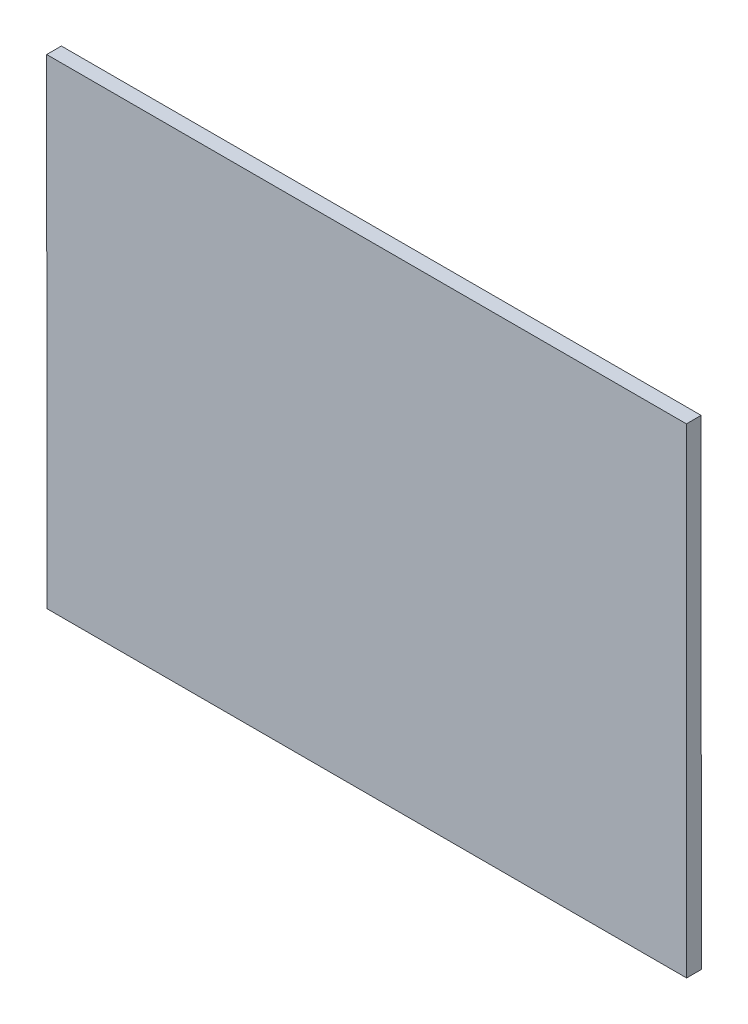
ISO-10303-21;
HEADER;
FILE_DESCRIPTION(('STEP AP214'),'2;1');
FILE_NAME('part.step','',(''),(''),'','','');
FILE_SCHEMA(('AUTOMOTIVE_DESIGN { 1 0 10303 214 1 1 1 1 }'));
ENDSEC;
DATA;
#1=APPLICATION_CONTEXT('core data for automotive mechanical design processes');
#2=APPLICATION_PROTOCOL_DEFINITION('international standard','automotive_design',2000,#1);
#3=PRODUCT_CONTEXT('',#1,'mechanical');
#4=PRODUCT('Part','Part','',(#3));
#5=PRODUCT_RELATED_PRODUCT_CATEGORY('part','',(#4));
#6=PRODUCT_DEFINITION_FORMATION('','',#4);
#7=PRODUCT_DEFINITION_CONTEXT('part definition',#1,'design');
#8=PRODUCT_DEFINITION('design','',#6,#7);
#9=PRODUCT_DEFINITION_SHAPE('','',#8);
#10=(LENGTH_UNIT() NAMED_UNIT(*) SI_UNIT(.MILLI.,.METRE.));
#11=(NAMED_UNIT(*) PLANE_ANGLE_UNIT() SI_UNIT($,.RADIAN.));
#12=(NAMED_UNIT(*) SI_UNIT($,.STERADIAN.) SOLID_ANGLE_UNIT());
#13=UNCERTAINTY_MEASURE_WITH_UNIT(LENGTH_MEASURE(1.E-05),#10,'distance_accuracy_value','');
#14=(GEOMETRIC_REPRESENTATION_CONTEXT(3) GLOBAL_UNCERTAINTY_ASSIGNED_CONTEXT((#13)) GLOBAL_UNIT_ASSIGNED_CONTEXT((#10,
#11,#12)) REPRESENTATION_CONTEXT('',''));
#15=CARTESIAN_POINT('',(0.,0.,0.));
#16=DIRECTION('',(0.,0.,1.));
#17=DIRECTION('',(1.,0.,0.));
#18=AXIS2_PLACEMENT_3D('',#15,#16,#17);
#19=CARTESIAN_POINT('',(167.229967884567,160.626483669053,2.3));
#20=DIRECTION('',(0.999999885677267,0.000478168854079985,0.));
#21=DIRECTION('',(-0.000478168854079985,0.999999885677267,0.));
#22=AXIS2_PLACEMENT_3D('',#19,#20,#21);
#23=PLANE('',#22);
#24=DIRECTION('',(0.000478168854079985,-0.999999885677267,0.));
#25=VECTOR('',#24,1.);
#26=CARTESIAN_POINT('',(167.229967884567,160.626483669053,0.));
#27=LINE('',#26,#25);
#28=CARTESIAN_POINT('',(167.229967884567,160.626483669053,0.));
#29=VERTEX_POINT('',#28);
#30=CARTESIAN_POINT('',(167.265830552723,85.6264836690532,0.));
#31=VERTEX_POINT('',#30);
#32=EDGE_CURVE('E100',#29,#31,#27,.T.);
#33=ORIENTED_EDGE('',*,*,#32,.T.);
#34=DIRECTION('',(0.,0.,-1.));
#35=VECTOR('',#34,1.);
#36=CARTESIAN_POINT('',(167.265830552723,85.6264836690532,2.3));
#37=LINE('',#36,#35);
#38=CARTESIAN_POINT('',(167.265830552723,85.6264836690532,2.3));
#39=VERTEX_POINT('',#38);
#40=EDGE_CURVE('E11',#39,#31,#37,.T.);
#41=ORIENTED_EDGE('',*,*,#40,.F.);
#42=DIRECTION('',(0.000478168854079985,-0.999999885677267,0.));
#43=VECTOR('',#42,1.);
#44=CARTESIAN_POINT('',(167.229967884567,160.626483669053,2.3));
#45=LINE('',#44,#43);
#46=CARTESIAN_POINT('',(167.229967884567,160.626483669053,2.3));
#47=VERTEX_POINT('',#46);
#48=EDGE_CURVE('E88',#47,#39,#45,.T.);
#49=ORIENTED_EDGE('',*,*,#48,.F.);
#50=DIRECTION('',(0.,0.,-1.));
#51=VECTOR('',#50,1.);
#52=CARTESIAN_POINT('',(167.229967884567,160.626483669053,2.3));
#53=LINE('',#52,#51);
#54=EDGE_CURVE('E96',#47,#29,#53,.T.);
#55=ORIENTED_EDGE('',*,*,#54,.T.);
#56=EDGE_LOOP('',(#33,#41,#49,#55));
#57=FACE_BOUND('',#56,.T.);
#58=ADVANCED_FACE('F37',(#57),#23,.F.);
#59=CARTESIAN_POINT('',(167.265830552723,85.6264836690532,2.3));
#60=DIRECTION('',(0.,1.,0.));
#61=DIRECTION('',(-1.,0.,0.));
#62=AXIS2_PLACEMENT_3D('',#59,#60,#61);
#63=PLANE('',#62);
#64=DIRECTION('',(1.,0.,0.));
#65=VECTOR('',#64,1.);
#66=CARTESIAN_POINT('',(167.265830552723,85.6264836690532,0.));
#67=LINE('',#66,#65);
#68=CARTESIAN_POINT('',(267.262891095904,85.6264836690532,0.));
#69=VERTEX_POINT('',#68);
#70=EDGE_CURVE('E92',#31,#69,#67,.T.);
#71=ORIENTED_EDGE('',*,*,#70,.T.);
#72=DIRECTION('',(0.,0.,-1.));
#73=VECTOR('',#72,1.);
#74=CARTESIAN_POINT('',(267.262891095904,85.6264836690532,2.3));
#75=LINE('',#74,#73);
#76=CARTESIAN_POINT('',(267.262891095904,85.6264836690532,2.3));
#77=VERTEX_POINT('',#76);
#78=EDGE_CURVE('E45',#77,#69,#75,.T.);
#79=ORIENTED_EDGE('',*,*,#78,.F.);
#80=DIRECTION('',(1.,0.,0.));
#81=VECTOR('',#80,1.);
#82=CARTESIAN_POINT('',(167.265830552723,85.6264836690532,2.3));
#83=LINE('',#82,#81);
#84=EDGE_CURVE('E83',#39,#77,#83,.T.);
#85=ORIENTED_EDGE('',*,*,#84,.F.);
#86=ORIENTED_EDGE('',*,*,#40,.T.);
#87=EDGE_LOOP('',(#71,#79,#85,#86));
#88=FACE_BOUND('',#87,.T.);
#89=ADVANCED_FACE('F91',(#88),#63,.F.);
#90=CARTESIAN_POINT('',(267.229967884567,160.626483669053,2.3));
#91=DIRECTION('',(-0.999999903649983,-0.000438976108856045,0.));
#92=DIRECTION('',(0.000438976108856045,-0.999999903649983,0.));
#93=AXIS2_PLACEMENT_3D('',#90,#91,#92);
#94=PLANE('',#93);
#95=DIRECTION('',(-0.000438976108856045,0.999999903649983,0.));
#96=VECTOR('',#95,1.);
#97=CARTESIAN_POINT('',(267.229967884567,160.626483669053,0.));
#98=LINE('',#97,#96);
#99=CARTESIAN_POINT('',(267.229967884567,160.626483669053,0.));
#100=VERTEX_POINT('',#99);
#101=EDGE_CURVE('E70',#69,#100,#98,.T.);
#102=ORIENTED_EDGE('',*,*,#101,.T.);
#103=DIRECTION('',(0.,0.,-1.));
#104=VECTOR('',#103,1.);
#105=CARTESIAN_POINT('',(267.229967884567,160.626483669053,2.3));
#106=LINE('',#105,#104);
#107=CARTESIAN_POINT('',(267.229967884567,160.626483669053,2.3));
#108=VERTEX_POINT('',#107);
#109=EDGE_CURVE('E93',#108,#100,#106,.T.);
#110=ORIENTED_EDGE('',*,*,#109,.F.);
#111=DIRECTION('',(-0.000438976108856045,0.999999903649983,0.));
#112=VECTOR('',#111,1.);
#113=CARTESIAN_POINT('',(267.229967884567,160.626483669053,2.3));
#114=LINE('',#113,#112);
#115=EDGE_CURVE('E86',#77,#108,#114,.T.);
#116=ORIENTED_EDGE('',*,*,#115,.F.);
#117=ORIENTED_EDGE('',*,*,#78,.T.);
#118=EDGE_LOOP('',(#102,#110,#116,#117));
#119=FACE_BOUND('',#118,.T.);
#120=ADVANCED_FACE('F94',(#119),#94,.F.);
#121=CARTESIAN_POINT('',(167.229967884567,160.626483669053,2.3));
#122=DIRECTION('',(0.,-1.,0.));
#123=DIRECTION('',(1.,0.,0.));
#124=AXIS2_PLACEMENT_3D('',#121,#122,#123);
#125=PLANE('',#124);
#126=DIRECTION('',(-1.,0.,0.));
#127=VECTOR('',#126,1.);
#128=CARTESIAN_POINT('',(167.229967884567,160.626483669053,0.));
#129=LINE('',#128,#127);
#130=EDGE_CURVE('E76',#100,#29,#129,.T.);
#131=ORIENTED_EDGE('',*,*,#130,.T.);
#132=ORIENTED_EDGE('',*,*,#54,.F.);
#133=DIRECTION('',(-1.,0.,0.));
#134=VECTOR('',#133,1.);
#135=CARTESIAN_POINT('',(167.229967884567,160.626483669053,2.3));
#136=LINE('',#135,#134);
#137=EDGE_CURVE('E53',#108,#47,#136,.T.);
#138=ORIENTED_EDGE('',*,*,#137,.F.);
#139=ORIENTED_EDGE('',*,*,#109,.T.);
#140=EDGE_LOOP('',(#131,#132,#138,#139));
#141=FACE_BOUND('',#140,.T.);
#142=ADVANCED_FACE('F107',(#141),#125,.F.);
#143=CARTESIAN_POINT('',(0.,0.,2.3));
#144=DIRECTION('',(0.,0.,1.));
#145=DIRECTION('',(1.,0.,0.));
#146=AXIS2_PLACEMENT_3D('',#143,#144,#145);
#147=PLANE('',#146);
#148=ORIENTED_EDGE('',*,*,#48,.T.);
#149=ORIENTED_EDGE('',*,*,#84,.T.);
#150=ORIENTED_EDGE('',*,*,#115,.T.);
#151=ORIENTED_EDGE('',*,*,#137,.T.);
#152=EDGE_LOOP('',(#148,#149,#150,#151));
#153=FACE_BOUND('',#152,.T.);
#154=ADVANCED_FACE('F84',(#153),#147,.T.);
#155=CARTESIAN_POINT('',(0.,0.,0.));
#156=DIRECTION('',(0.,0.,1.));
#157=DIRECTION('',(1.,0.,0.));
#158=AXIS2_PLACEMENT_3D('',#155,#156,#157);
#159=PLANE('',#158);
#160=ORIENTED_EDGE('',*,*,#32,.F.);
#161=ORIENTED_EDGE('',*,*,#130,.F.);
#162=ORIENTED_EDGE('',*,*,#101,.F.);
#163=ORIENTED_EDGE('',*,*,#70,.F.);
#164=EDGE_LOOP('',(#160,#161,#162,#163));
#165=FACE_BOUND('',#164,.T.);
#166=ADVANCED_FACE('F110',(#165),#159,.F.);
#167=CLOSED_SHELL('',(#58,#89,#120,#142,#154,#166));
#168=MANIFOLD_SOLID_BREP('B2',#167);
#169=ADVANCED_BREP_SHAPE_REPRESENTATION('',(#18,#168),#14);
#170=SHAPE_DEFINITION_REPRESENTATION(#9,#169);
ENDSEC;
END-ISO-10303-21;
